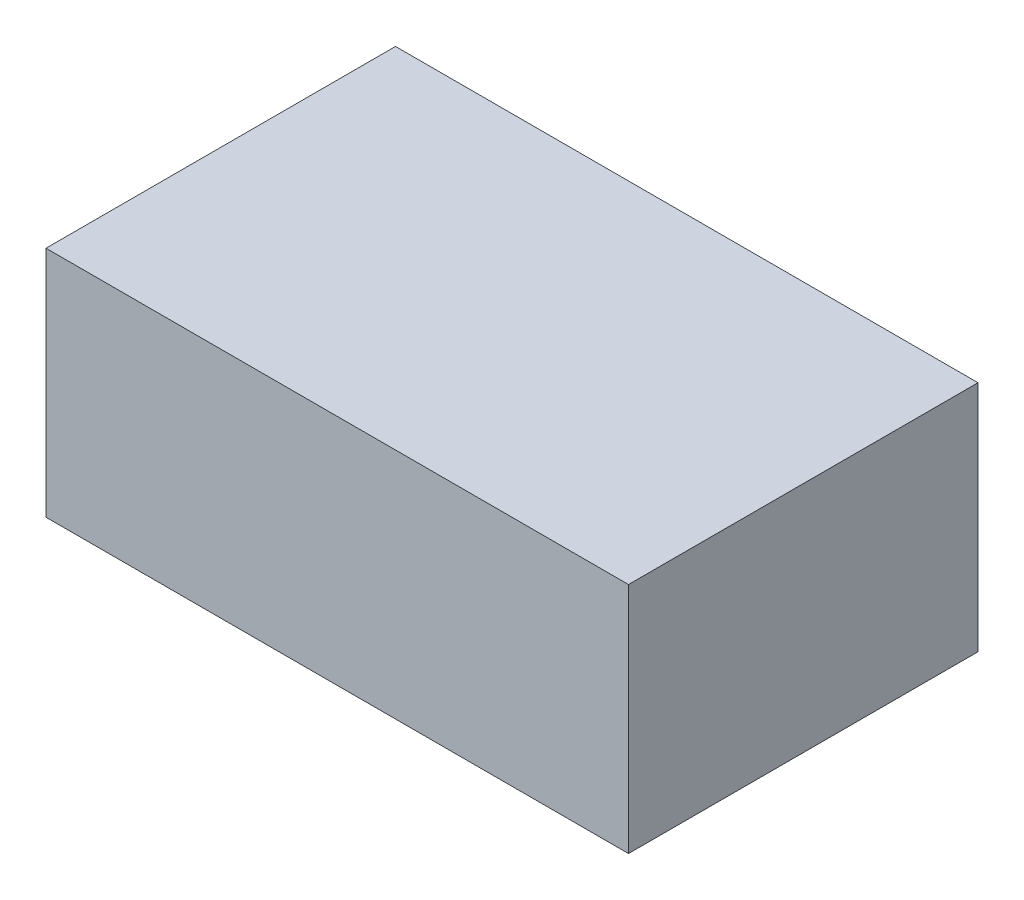
ISO-10303-21;
HEADER;
FILE_DESCRIPTION(('STEP AP214'),'2;1');
FILE_NAME('part.step','',(''),(''),'','','');
FILE_SCHEMA(('AUTOMOTIVE_DESIGN { 1 0 10303 214 1 1 1 1 }'));
ENDSEC;
DATA;
#1=APPLICATION_CONTEXT('core data for automotive mechanical design processes');
#2=APPLICATION_PROTOCOL_DEFINITION('international standard','automotive_design',2000,#1);
#3=PRODUCT_CONTEXT('',#1,'mechanical');
#4=PRODUCT('Part','Part','',(#3));
#5=PRODUCT_RELATED_PRODUCT_CATEGORY('part','',(#4));
#6=PRODUCT_DEFINITION_FORMATION('','',#4);
#7=PRODUCT_DEFINITION_CONTEXT('part definition',#1,'design');
#8=PRODUCT_DEFINITION('design','',#6,#7);
#9=PRODUCT_DEFINITION_SHAPE('','',#8);
#10=(LENGTH_UNIT() NAMED_UNIT(*) SI_UNIT(.MILLI.,.METRE.));
#11=(NAMED_UNIT(*) PLANE_ANGLE_UNIT() SI_UNIT($,.RADIAN.));
#12=(NAMED_UNIT(*) SI_UNIT($,.STERADIAN.) SOLID_ANGLE_UNIT());
#13=UNCERTAINTY_MEASURE_WITH_UNIT(LENGTH_MEASURE(1.E-05),#10,'distance_accuracy_value','');
#14=(GEOMETRIC_REPRESENTATION_CONTEXT(3) GLOBAL_UNCERTAINTY_ASSIGNED_CONTEXT((#13)) GLOBAL_UNIT_ASSIGNED_CONTEXT((#10,
#11,#12)) REPRESENTATION_CONTEXT('',''));
#15=CARTESIAN_POINT('',(0.,0.,0.));
#16=DIRECTION('',(0.,0.,1.));
#17=DIRECTION('',(1.,0.,0.));
#18=AXIS2_PLACEMENT_3D('',#15,#16,#17);
#19=CARTESIAN_POINT('',(-30.,-24.,18.));
#20=DIRECTION('',(-1.,0.,0.));
#21=DIRECTION('',(0.,0.,1.));
#22=AXIS2_PLACEMENT_3D('',#19,#20,#21);
#23=PLANE('',#22);
#24=DIRECTION('',(0.,0.,1.));
#25=VECTOR('',#24,1.);
#26=CARTESIAN_POINT('',(-30.,0.,18.));
#27=LINE('',#26,#25);
#28=CARTESIAN_POINT('',(-30.,0.,-18.));
#29=VERTEX_POINT('',#28);
#30=CARTESIAN_POINT('',(-30.,0.,18.));
#31=VERTEX_POINT('',#30);
#32=EDGE_CURVE('E109',#29,#31,#27,.T.);
#33=ORIENTED_EDGE('',*,*,#32,.F.);
#34=DIRECTION('',(0.,1.,0.));
#35=VECTOR('',#34,1.);
#36=CARTESIAN_POINT('',(-30.,-24.,-18.));
#37=LINE('',#36,#35);
#38=CARTESIAN_POINT('',(-30.,-24.,-18.));
#39=VERTEX_POINT('',#38);
#40=EDGE_CURVE('E11',#39,#29,#37,.T.);
#41=ORIENTED_EDGE('',*,*,#40,.F.);
#42=DIRECTION('',(0.,0.,1.));
#43=VECTOR('',#42,1.);
#44=CARTESIAN_POINT('',(-30.,-24.,18.));
#45=LINE('',#44,#43);
#46=CARTESIAN_POINT('',(-30.,-24.,18.));
#47=VERTEX_POINT('',#46);
#48=EDGE_CURVE('E101',#39,#47,#45,.T.);
#49=ORIENTED_EDGE('',*,*,#48,.T.);
#50=DIRECTION('',(0.,1.,0.));
#51=VECTOR('',#50,1.);
#52=CARTESIAN_POINT('',(-30.,-24.,18.));
#53=LINE('',#52,#51);
#54=EDGE_CURVE('E42',#47,#31,#53,.T.);
#55=ORIENTED_EDGE('',*,*,#54,.T.);
#56=EDGE_LOOP('',(#33,#41,#49,#55));
#57=FACE_BOUND('',#56,.T.);
#58=ADVANCED_FACE('F39',(#57),#23,.T.);
#59=CARTESIAN_POINT('',(30.,-24.,-18.));
#60=DIRECTION('',(0.,0.,-1.));
#61=DIRECTION('',(-1.,0.,0.));
#62=AXIS2_PLACEMENT_3D('',#59,#60,#61);
#63=PLANE('',#62);
#64=DIRECTION('',(-1.,0.,0.));
#65=VECTOR('',#64,1.);
#66=CARTESIAN_POINT('',(30.,0.,-18.));
#67=LINE('',#66,#65);
#68=CARTESIAN_POINT('',(30.,0.,-18.));
#69=VERTEX_POINT('',#68);
#70=EDGE_CURVE('E104',#69,#29,#67,.T.);
#71=ORIENTED_EDGE('',*,*,#70,.F.);
#72=DIRECTION('',(0.,1.,0.));
#73=VECTOR('',#72,1.);
#74=CARTESIAN_POINT('',(30.,-24.,-18.));
#75=LINE('',#74,#73);
#76=CARTESIAN_POINT('',(30.,-24.,-18.));
#77=VERTEX_POINT('',#76);
#78=EDGE_CURVE('E49',#77,#69,#75,.T.);
#79=ORIENTED_EDGE('',*,*,#78,.F.);
#80=DIRECTION('',(-1.,0.,0.));
#81=VECTOR('',#80,1.);
#82=CARTESIAN_POINT('',(30.,-24.,-18.));
#83=LINE('',#82,#81);
#84=EDGE_CURVE('E96',#77,#39,#83,.T.);
#85=ORIENTED_EDGE('',*,*,#84,.T.);
#86=ORIENTED_EDGE('',*,*,#40,.T.);
#87=EDGE_LOOP('',(#71,#79,#85,#86));
#88=FACE_BOUND('',#87,.T.);
#89=ADVANCED_FACE('F125',(#88),#63,.T.);
#90=CARTESIAN_POINT('',(30.,-24.,18.));
#91=DIRECTION('',(1.,0.,0.));
#92=DIRECTION('',(0.,0.,-1.));
#93=AXIS2_PLACEMENT_3D('',#90,#91,#92);
#94=PLANE('',#93);
#95=DIRECTION('',(0.,0.,-1.));
#96=VECTOR('',#95,1.);
#97=CARTESIAN_POINT('',(30.,0.,18.));
#98=LINE('',#97,#96);
#99=CARTESIAN_POINT('',(30.,0.,18.));
#100=VERTEX_POINT('',#99);
#101=EDGE_CURVE('E90',#100,#69,#98,.T.);
#102=ORIENTED_EDGE('',*,*,#101,.F.);
#103=DIRECTION('',(0.,1.,0.));
#104=VECTOR('',#103,1.);
#105=CARTESIAN_POINT('',(30.,-24.,18.));
#106=LINE('',#105,#104);
#107=CARTESIAN_POINT('',(30.,-24.,18.));
#108=VERTEX_POINT('',#107);
#109=EDGE_CURVE('E85',#108,#100,#106,.T.);
#110=ORIENTED_EDGE('',*,*,#109,.F.);
#111=DIRECTION('',(0.,0.,-1.));
#112=VECTOR('',#111,1.);
#113=CARTESIAN_POINT('',(30.,-24.,18.));
#114=LINE('',#113,#112);
#115=EDGE_CURVE('E88',#108,#77,#114,.T.);
#116=ORIENTED_EDGE('',*,*,#115,.T.);
#117=ORIENTED_EDGE('',*,*,#78,.T.);
#118=EDGE_LOOP('',(#102,#110,#116,#117));
#119=FACE_BOUND('',#118,.T.);
#120=ADVANCED_FACE('F87',(#119),#94,.T.);
#121=CARTESIAN_POINT('',(30.,-24.,18.));
#122=DIRECTION('',(0.,0.,1.));
#123=DIRECTION('',(1.,0.,0.));
#124=AXIS2_PLACEMENT_3D('',#121,#122,#123);
#125=PLANE('',#124);
#126=DIRECTION('',(1.,0.,0.));
#127=VECTOR('',#126,1.);
#128=CARTESIAN_POINT('',(30.,0.,18.));
#129=LINE('',#128,#127);
#130=EDGE_CURVE('E113',#31,#100,#129,.T.);
#131=ORIENTED_EDGE('',*,*,#130,.F.);
#132=ORIENTED_EDGE('',*,*,#54,.F.);
#133=DIRECTION('',(1.,0.,0.));
#134=VECTOR('',#133,1.);
#135=CARTESIAN_POINT('',(30.,-24.,18.));
#136=LINE('',#135,#134);
#137=EDGE_CURVE('E95',#47,#108,#136,.T.);
#138=ORIENTED_EDGE('',*,*,#137,.T.);
#139=ORIENTED_EDGE('',*,*,#109,.T.);
#140=EDGE_LOOP('',(#131,#132,#138,#139));
#141=FACE_BOUND('',#140,.T.);
#142=ADVANCED_FACE('F99',(#141),#125,.T.);
#143=CARTESIAN_POINT('',(0.,-24.,0.));
#144=DIRECTION('',(0.,1.,0.));
#145=DIRECTION('',(0.,0.,1.));
#146=AXIS2_PLACEMENT_3D('',#143,#144,#145);
#147=PLANE('',#146);
#148=ORIENTED_EDGE('',*,*,#48,.F.);
#149=ORIENTED_EDGE('',*,*,#84,.F.);
#150=ORIENTED_EDGE('',*,*,#115,.F.);
#151=ORIENTED_EDGE('',*,*,#137,.F.);
#152=EDGE_LOOP('',(#148,#149,#150,#151));
#153=FACE_BOUND('',#152,.T.);
#154=ADVANCED_FACE('F94',(#153),#147,.F.);
#155=CARTESIAN_POINT('',(0.,0.,0.));
#156=DIRECTION('',(0.,1.,0.));
#157=DIRECTION('',(0.,0.,1.));
#158=AXIS2_PLACEMENT_3D('',#155,#156,#157);
#159=PLANE('',#158);
#160=ORIENTED_EDGE('',*,*,#32,.T.);
#161=ORIENTED_EDGE('',*,*,#130,.T.);
#162=ORIENTED_EDGE('',*,*,#101,.T.);
#163=ORIENTED_EDGE('',*,*,#70,.T.);
#164=EDGE_LOOP('',(#160,#161,#162,#163));
#165=FACE_BOUND('',#164,.T.);
#166=ADVANCED_FACE('F124',(#165),#159,.T.);
#167=CLOSED_SHELL('',(#58,#89,#120,#142,#154,#166));
#168=MANIFOLD_SOLID_BREP('B2',#167);
#169=ADVANCED_BREP_SHAPE_REPRESENTATION('',(#18,#168),#14);
#170=SHAPE_DEFINITION_REPRESENTATION(#9,#169);
ENDSEC;
END-ISO-10303-21;
